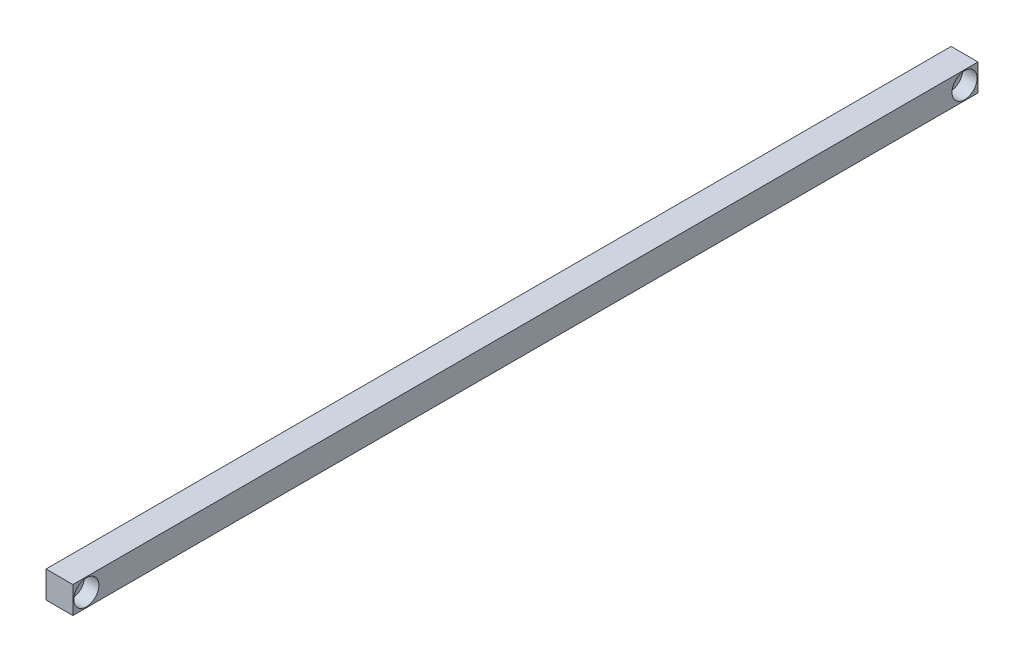
ISO-10303-21;
HEADER;
FILE_DESCRIPTION(('STEP AP214'),'2;1');
FILE_NAME('part.step','',(''),(''),'','','');
FILE_SCHEMA(('AUTOMOTIVE_DESIGN { 1 0 10303 214 1 1 1 1 }'));
ENDSEC;
DATA;
#1=APPLICATION_CONTEXT('core data for automotive mechanical design processes');
#2=APPLICATION_PROTOCOL_DEFINITION('international standard','automotive_design',2000,#1);
#3=PRODUCT_CONTEXT('',#1,'mechanical');
#4=PRODUCT('Part','Part','',(#3));
#5=PRODUCT_RELATED_PRODUCT_CATEGORY('part','',(#4));
#6=PRODUCT_DEFINITION_FORMATION('','',#4);
#7=PRODUCT_DEFINITION_CONTEXT('part definition',#1,'design');
#8=PRODUCT_DEFINITION('design','',#6,#7);
#9=PRODUCT_DEFINITION_SHAPE('','',#8);
#10=(LENGTH_UNIT() NAMED_UNIT(*) SI_UNIT(.MILLI.,.METRE.));
#11=(NAMED_UNIT(*) PLANE_ANGLE_UNIT() SI_UNIT($,.RADIAN.));
#12=(NAMED_UNIT(*) SI_UNIT($,.STERADIAN.) SOLID_ANGLE_UNIT());
#13=UNCERTAINTY_MEASURE_WITH_UNIT(LENGTH_MEASURE(1.E-05),#10,'distance_accuracy_value','');
#14=(GEOMETRIC_REPRESENTATION_CONTEXT(3) GLOBAL_UNCERTAINTY_ASSIGNED_CONTEXT((#13)) GLOBAL_UNIT_ASSIGNED_CONTEXT((#10,
#11,#12)) REPRESENTATION_CONTEXT('',''));
#15=CARTESIAN_POINT('',(0.,0.,0.));
#16=DIRECTION('',(0.,0.,1.));
#17=DIRECTION('',(1.,0.,0.));
#18=AXIS2_PLACEMENT_3D('',#15,#16,#17);
#19=CARTESIAN_POINT('',(7.5,7.5,252.5));
#20=DIRECTION('',(-1.,0.,0.));
#21=DIRECTION('',(0.,-1.,0.));
#22=AXIS2_PLACEMENT_3D('',#19,#20,#21);
#23=PLANE('',#22);
#24=CARTESIAN_POINT('',(7.5,0.,245.));
#25=DIRECTION('',(1.,0.,0.));
#26=DIRECTION('',(0.,0.,-1.));
#27=AXIS2_PLACEMENT_3D('',#24,#25,#26);
#28=CIRCLE('',#27,7.00000000000001);
#29=CARTESIAN_POINT('',(7.5,0.,238.));
#30=VERTEX_POINT('',#29);
#31=EDGE_CURVE('E131',#30,#30,#28,.T.);
#32=ORIENTED_EDGE('',*,*,#31,.F.);
#33=EDGE_LOOP('',(#32));
#34=FACE_BOUND('',#33,.T.);
#35=CARTESIAN_POINT('',(7.5,0.,-245.));
#36=DIRECTION('',(1.,0.,0.));
#37=DIRECTION('',(0.,0.,-1.));
#38=AXIS2_PLACEMENT_3D('',#35,#36,#37);
#39=CIRCLE('',#38,7.00000000000001);
#40=CARTESIAN_POINT('',(7.5,0.,-252.));
#41=VERTEX_POINT('',#40);
#42=EDGE_CURVE('E119',#41,#41,#39,.T.);
#43=ORIENTED_EDGE('',*,*,#42,.F.);
#44=EDGE_LOOP('',(#43));
#45=FACE_BOUND('',#44,.T.);
#46=DIRECTION('',(0.,1.,0.));
#47=VECTOR('',#46,1.);
#48=CARTESIAN_POINT('',(7.5,7.5,-252.5));
#49=LINE('',#48,#47);
#50=CARTESIAN_POINT('',(7.5,-7.5,-252.5));
#51=VERTEX_POINT('',#50);
#52=CARTESIAN_POINT('',(7.5,7.5,-252.5));
#53=VERTEX_POINT('',#52);
#54=EDGE_CURVE('E97',#51,#53,#49,.T.);
#55=ORIENTED_EDGE('',*,*,#54,.T.);
#56=DIRECTION('',(0.,0.,-1.));
#57=VECTOR('',#56,1.);
#58=CARTESIAN_POINT('',(7.5,7.5,252.5));
#59=LINE('',#58,#57);
#60=CARTESIAN_POINT('',(7.5,7.5,252.5));
#61=VERTEX_POINT('',#60);
#62=EDGE_CURVE('E11',#61,#53,#59,.T.);
#63=ORIENTED_EDGE('',*,*,#62,.F.);
#64=DIRECTION('',(0.,1.,0.));
#65=VECTOR('',#64,1.);
#66=CARTESIAN_POINT('',(7.5,7.5,252.5));
#67=LINE('',#66,#65);
#68=CARTESIAN_POINT('',(7.5,-7.5,252.5));
#69=VERTEX_POINT('',#68);
#70=EDGE_CURVE('E85',#69,#61,#67,.T.);
#71=ORIENTED_EDGE('',*,*,#70,.F.);
#72=DIRECTION('',(0.,0.,-1.));
#73=VECTOR('',#72,1.);
#74=CARTESIAN_POINT('',(7.5,-7.5,252.5));
#75=LINE('',#74,#73);
#76=EDGE_CURVE('E93',#69,#51,#75,.T.);
#77=ORIENTED_EDGE('',*,*,#76,.T.);
#78=EDGE_LOOP('',(#55,#63,#71,#77));
#79=FACE_BOUND('',#78,.T.);
#80=ADVANCED_FACE('F34',(#34,#45,#79),#23,.F.);
#81=CARTESIAN_POINT('',(-7.5,7.5,252.5));
#82=DIRECTION('',(0.,-1.,0.));
#83=DIRECTION('',(0.,0.,-1.));
#84=AXIS2_PLACEMENT_3D('',#81,#82,#83);
#85=PLANE('',#84);
#86=DIRECTION('',(-1.,0.,0.));
#87=VECTOR('',#86,1.);
#88=CARTESIAN_POINT('',(-7.5,7.5,-252.5));
#89=LINE('',#88,#87);
#90=CARTESIAN_POINT('',(-7.5,7.5,-252.5));
#91=VERTEX_POINT('',#90);
#92=EDGE_CURVE('E89',#53,#91,#89,.T.);
#93=ORIENTED_EDGE('',*,*,#92,.T.);
#94=DIRECTION('',(0.,0.,-1.));
#95=VECTOR('',#94,1.);
#96=CARTESIAN_POINT('',(-7.5,7.5,252.5));
#97=LINE('',#96,#95);
#98=CARTESIAN_POINT('',(-7.5,7.5,252.5));
#99=VERTEX_POINT('',#98);
#100=EDGE_CURVE('E42',#99,#91,#97,.T.);
#101=ORIENTED_EDGE('',*,*,#100,.F.);
#102=DIRECTION('',(-1.,0.,0.));
#103=VECTOR('',#102,1.);
#104=CARTESIAN_POINT('',(-7.5,7.5,252.5));
#105=LINE('',#104,#103);
#106=EDGE_CURVE('E80',#61,#99,#105,.T.);
#107=ORIENTED_EDGE('',*,*,#106,.F.);
#108=ORIENTED_EDGE('',*,*,#62,.T.);
#109=EDGE_LOOP('',(#93,#101,#107,#108));
#110=FACE_BOUND('',#109,.T.);
#111=ADVANCED_FACE('F88',(#110),#85,.F.);
#112=CARTESIAN_POINT('',(-7.5,7.5,252.5));
#113=DIRECTION('',(1.,0.,0.));
#114=DIRECTION('',(0.,1.,0.));
#115=AXIS2_PLACEMENT_3D('',#112,#113,#114);
#116=PLANE('',#115);
#117=CARTESIAN_POINT('',(-7.5,0.,245.));
#118=DIRECTION('',(1.,0.,0.));
#119=DIRECTION('',(0.,0.,-1.));
#120=AXIS2_PLACEMENT_3D('',#117,#118,#119);
#121=CIRCLE('',#120,4.25000000000001);
#122=CARTESIAN_POINT('',(-7.5,0.,240.75));
#123=VERTEX_POINT('',#122);
#124=EDGE_CURVE('E122',#123,#123,#121,.T.);
#125=ORIENTED_EDGE('',*,*,#124,.T.);
#126=EDGE_LOOP('',(#125));
#127=FACE_BOUND('',#126,.T.);
#128=CARTESIAN_POINT('',(-7.5,0.,-245.));
#129=DIRECTION('',(1.,0.,0.));
#130=DIRECTION('',(0.,0.,-1.));
#131=AXIS2_PLACEMENT_3D('',#128,#129,#130);
#132=CIRCLE('',#131,4.25000000000001);
#133=CARTESIAN_POINT('',(-7.5,0.,-249.25));
#134=VERTEX_POINT('',#133);
#135=EDGE_CURVE('E100',#134,#134,#132,.T.);
#136=ORIENTED_EDGE('',*,*,#135,.T.);
#137=EDGE_LOOP('',(#136));
#138=FACE_BOUND('',#137,.T.);
#139=DIRECTION('',(0.,-1.,0.));
#140=VECTOR('',#139,1.);
#141=CARTESIAN_POINT('',(-7.5,7.5,-252.5));
#142=LINE('',#141,#140);
#143=CARTESIAN_POINT('',(-7.5,-7.5,-252.5));
#144=VERTEX_POINT('',#143);
#145=EDGE_CURVE('E67',#91,#144,#142,.T.);
#146=ORIENTED_EDGE('',*,*,#145,.T.);
#147=DIRECTION('',(0.,0.,-1.));
#148=VECTOR('',#147,1.);
#149=CARTESIAN_POINT('',(-7.5,-7.5,252.5));
#150=LINE('',#149,#148);
#151=CARTESIAN_POINT('',(-7.5,-7.5,252.5));
#152=VERTEX_POINT('',#151);
#153=EDGE_CURVE('E90',#152,#144,#150,.T.);
#154=ORIENTED_EDGE('',*,*,#153,.F.);
#155=DIRECTION('',(0.,-1.,0.));
#156=VECTOR('',#155,1.);
#157=CARTESIAN_POINT('',(-7.5,7.5,252.5));
#158=LINE('',#157,#156);
#159=EDGE_CURVE('E83',#99,#152,#158,.T.);
#160=ORIENTED_EDGE('',*,*,#159,.F.);
#161=ORIENTED_EDGE('',*,*,#100,.T.);
#162=EDGE_LOOP('',(#146,#154,#160,#161));
#163=FACE_BOUND('',#162,.T.);
#164=ADVANCED_FACE('F91',(#127,#138,#163),#116,.F.);
#165=CARTESIAN_POINT('',(-7.5,-7.5,252.5));
#166=DIRECTION('',(0.,1.,0.));
#167=DIRECTION('',(0.,0.,1.));
#168=AXIS2_PLACEMENT_3D('',#165,#166,#167);
#169=PLANE('',#168);
#170=DIRECTION('',(1.,0.,0.));
#171=VECTOR('',#170,1.);
#172=CARTESIAN_POINT('',(-7.5,-7.5,-252.5));
#173=LINE('',#172,#171);
#174=EDGE_CURVE('E73',#144,#51,#173,.T.);
#175=ORIENTED_EDGE('',*,*,#174,.T.);
#176=ORIENTED_EDGE('',*,*,#76,.F.);
#177=DIRECTION('',(1.,0.,0.));
#178=VECTOR('',#177,1.);
#179=CARTESIAN_POINT('',(-7.5,-7.5,252.5));
#180=LINE('',#179,#178);
#181=EDGE_CURVE('E50',#152,#69,#180,.T.);
#182=ORIENTED_EDGE('',*,*,#181,.F.);
#183=ORIENTED_EDGE('',*,*,#153,.T.);
#184=EDGE_LOOP('',(#175,#176,#182,#183));
#185=FACE_BOUND('',#184,.T.);
#186=ADVANCED_FACE('F105',(#185),#169,.F.);
#187=CARTESIAN_POINT('',(0.,0.,252.5));
#188=DIRECTION('',(0.,0.,1.));
#189=DIRECTION('',(1.,0.,0.));
#190=AXIS2_PLACEMENT_3D('',#187,#188,#189);
#191=PLANE('',#190);
#192=ORIENTED_EDGE('',*,*,#70,.T.);
#193=ORIENTED_EDGE('',*,*,#106,.T.);
#194=ORIENTED_EDGE('',*,*,#159,.T.);
#195=ORIENTED_EDGE('',*,*,#181,.T.);
#196=EDGE_LOOP('',(#192,#193,#194,#195));
#197=FACE_BOUND('',#196,.T.);
#198=ADVANCED_FACE('F81',(#197),#191,.T.);
#199=CARTESIAN_POINT('',(0.,0.,-252.5));
#200=DIRECTION('',(0.,0.,1.));
#201=DIRECTION('',(1.,0.,0.));
#202=AXIS2_PLACEMENT_3D('',#199,#200,#201);
#203=PLANE('',#202);
#204=ORIENTED_EDGE('',*,*,#54,.F.);
#205=ORIENTED_EDGE('',*,*,#174,.F.);
#206=ORIENTED_EDGE('',*,*,#145,.F.);
#207=ORIENTED_EDGE('',*,*,#92,.F.);
#208=EDGE_LOOP('',(#204,#205,#206,#207));
#209=FACE_BOUND('',#208,.T.);
#210=ADVANCED_FACE('F108',(#209),#203,.F.);
#211=CARTESIAN_POINT('',(7.5,0.,-245.));
#212=DIRECTION('',(1.,0.,0.));
#213=DIRECTION('',(0.,0.,-1.));
#214=AXIS2_PLACEMENT_3D('',#211,#212,#213);
#215=CYLINDRICAL_SURFACE('',#214,4.25000000000001);
#216=ORIENTED_EDGE('',*,*,#135,.F.);
#217=EDGE_LOOP('',(#216));
#218=FACE_BOUND('',#217,.T.);
#219=CARTESIAN_POINT('',(-0.499999999999999,0.,-245.));
#220=DIRECTION('',(1.,0.,0.));
#221=DIRECTION('',(0.,0.,-1.));
#222=AXIS2_PLACEMENT_3D('',#219,#220,#221);
#223=CIRCLE('',#222,4.25000000000001);
#224=CARTESIAN_POINT('',(-0.499999999999999,0.,-249.25));
#225=VERTEX_POINT('',#224);
#226=EDGE_CURVE('E113',#225,#225,#223,.T.);
#227=ORIENTED_EDGE('',*,*,#226,.T.);
#228=EDGE_LOOP('',(#227));
#229=FACE_BOUND('',#228,.T.);
#230=ADVANCED_FACE('F154',(#218,#229),#215,.F.);
#231=CARTESIAN_POINT('',(-0.499999999999999,4.25000000000001,-245.));
#232=DIRECTION('',(-1.,0.,0.));
#233=DIRECTION('',(0.,0.,1.));
#234=AXIS2_PLACEMENT_3D('',#231,#232,#233);
#235=PLANE('',#234);
#236=ORIENTED_EDGE('',*,*,#226,.F.);
#237=EDGE_LOOP('',(#236));
#238=FACE_BOUND('',#237,.T.);
#239=CARTESIAN_POINT('',(-0.499999999999999,0.,-245.));
#240=DIRECTION('',(1.,0.,0.));
#241=DIRECTION('',(0.,0.,-1.));
#242=AXIS2_PLACEMENT_3D('',#239,#240,#241);
#243=CIRCLE('',#242,7.00000000000001);
#244=CARTESIAN_POINT('',(-0.499999999999999,0.,-252.));
#245=VERTEX_POINT('',#244);
#246=EDGE_CURVE('E116',#245,#245,#243,.T.);
#247=ORIENTED_EDGE('',*,*,#246,.T.);
#248=EDGE_LOOP('',(#247));
#249=FACE_BOUND('',#248,.T.);
#250=ADVANCED_FACE('F144',(#238,#249),#235,.F.);
#251=CARTESIAN_POINT('',(7.5,0.,-245.));
#252=DIRECTION('',(1.,0.,0.));
#253=DIRECTION('',(0.,0.,-1.));
#254=AXIS2_PLACEMENT_3D('',#251,#252,#253);
#255=CYLINDRICAL_SURFACE('',#254,7.00000000000001);
#256=ORIENTED_EDGE('',*,*,#246,.F.);
#257=EDGE_LOOP('',(#256));
#258=FACE_BOUND('',#257,.T.);
#259=ORIENTED_EDGE('',*,*,#42,.T.);
#260=EDGE_LOOP('',(#259));
#261=FACE_BOUND('',#260,.T.);
#262=ADVANCED_FACE('F141',(#258,#261),#255,.F.);
#263=CARTESIAN_POINT('',(7.5,0.,245.));
#264=DIRECTION('',(1.,0.,0.));
#265=DIRECTION('',(0.,0.,-1.));
#266=AXIS2_PLACEMENT_3D('',#263,#264,#265);
#267=CYLINDRICAL_SURFACE('',#266,4.25000000000001);
#268=ORIENTED_EDGE('',*,*,#124,.F.);
#269=EDGE_LOOP('',(#268));
#270=FACE_BOUND('',#269,.T.);
#271=CARTESIAN_POINT('',(-0.499999999999999,0.,245.));
#272=DIRECTION('',(1.,0.,0.));
#273=DIRECTION('',(0.,0.,-1.));
#274=AXIS2_PLACEMENT_3D('',#271,#272,#273);
#275=CIRCLE('',#274,4.25000000000001);
#276=CARTESIAN_POINT('',(-0.499999999999999,0.,240.75));
#277=VERTEX_POINT('',#276);
#278=EDGE_CURVE('E125',#277,#277,#275,.T.);
#279=ORIENTED_EDGE('',*,*,#278,.T.);
#280=EDGE_LOOP('',(#279));
#281=FACE_BOUND('',#280,.T.);
#282=ADVANCED_FACE('F143',(#270,#281),#267,.F.);
#283=CARTESIAN_POINT('',(-0.499999999999999,4.25000000000001,245.));
#284=DIRECTION('',(-1.,0.,0.));
#285=DIRECTION('',(0.,0.,1.));
#286=AXIS2_PLACEMENT_3D('',#283,#284,#285);
#287=PLANE('',#286);
#288=ORIENTED_EDGE('',*,*,#278,.F.);
#289=EDGE_LOOP('',(#288));
#290=FACE_BOUND('',#289,.T.);
#291=CARTESIAN_POINT('',(-0.499999999999999,0.,245.));
#292=DIRECTION('',(1.,0.,0.));
#293=DIRECTION('',(0.,0.,-1.));
#294=AXIS2_PLACEMENT_3D('',#291,#292,#293);
#295=CIRCLE('',#294,7.00000000000001);
#296=CARTESIAN_POINT('',(-0.499999999999999,0.,238.));
#297=VERTEX_POINT('',#296);
#298=EDGE_CURVE('E128',#297,#297,#295,.T.);
#299=ORIENTED_EDGE('',*,*,#298,.T.);
#300=EDGE_LOOP('',(#299));
#301=FACE_BOUND('',#300,.T.);
#302=ADVANCED_FACE('F151',(#290,#301),#287,.F.);
#303=CARTESIAN_POINT('',(7.5,0.,245.));
#304=DIRECTION('',(1.,0.,0.));
#305=DIRECTION('',(0.,0.,-1.));
#306=AXIS2_PLACEMENT_3D('',#303,#304,#305);
#307=CYLINDRICAL_SURFACE('',#306,7.00000000000001);
#308=ORIENTED_EDGE('',*,*,#298,.F.);
#309=EDGE_LOOP('',(#308));
#310=FACE_BOUND('',#309,.T.);
#311=ORIENTED_EDGE('',*,*,#31,.T.);
#312=EDGE_LOOP('',(#311));
#313=FACE_BOUND('',#312,.T.);
#314=ADVANCED_FACE('F135',(#310,#313),#307,.F.);
#315=CLOSED_SHELL('',(#80,#111,#164,#186,#198,#210,#230,#250,#262,#282,#302,#314));
#316=MANIFOLD_SOLID_BREP('B2',#315);
#317=ADVANCED_BREP_SHAPE_REPRESENTATION('',(#18,#316),#14);
#318=SHAPE_DEFINITION_REPRESENTATION(#9,#317);
ENDSEC;
END-ISO-10303-21;
